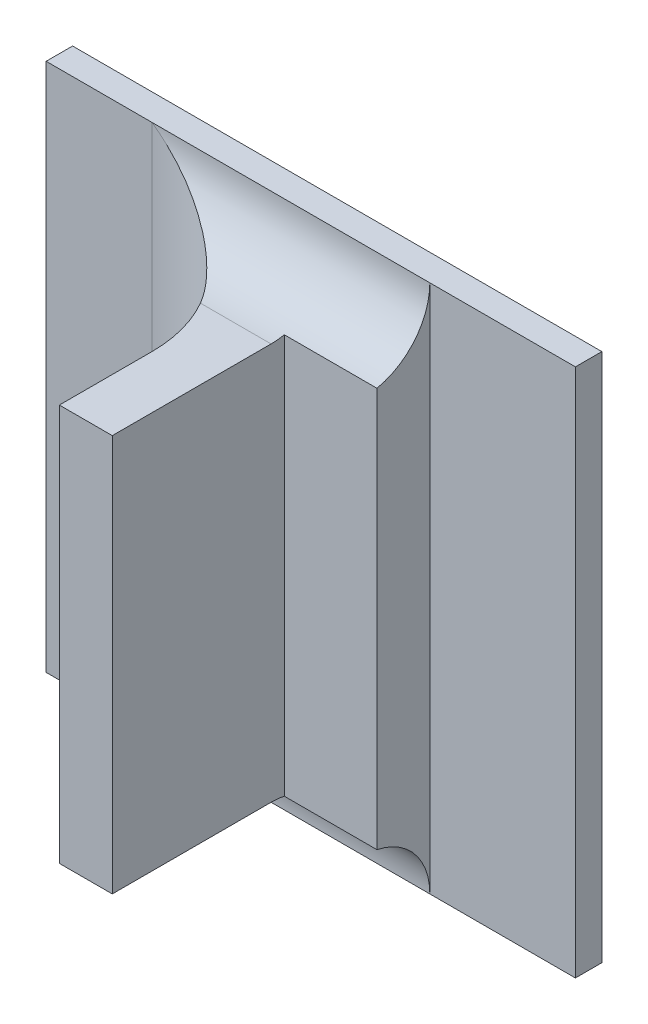
ISO-10303-21;
HEADER;
FILE_DESCRIPTION(('STEP AP214'),'2;1');
FILE_NAME('part.step','',(''),(''),'','','');
FILE_SCHEMA(('AUTOMOTIVE_DESIGN { 1 0 10303 214 1 1 1 1 }'));
ENDSEC;
DATA;
#1=APPLICATION_CONTEXT('core data for automotive mechanical design processes');
#2=APPLICATION_PROTOCOL_DEFINITION('international standard','automotive_design',2000,#1);
#3=PRODUCT_CONTEXT('',#1,'mechanical');
#4=PRODUCT('Part','Part','',(#3));
#5=PRODUCT_RELATED_PRODUCT_CATEGORY('part','',(#4));
#6=PRODUCT_DEFINITION_FORMATION('','',#4);
#7=PRODUCT_DEFINITION_CONTEXT('part definition',#1,'design');
#8=PRODUCT_DEFINITION('design','',#6,#7);
#9=PRODUCT_DEFINITION_SHAPE('','',#8);
#10=(LENGTH_UNIT() NAMED_UNIT(*) SI_UNIT(.MILLI.,.METRE.));
#11=(NAMED_UNIT(*) PLANE_ANGLE_UNIT() SI_UNIT($,.RADIAN.));
#12=(NAMED_UNIT(*) SI_UNIT($,.STERADIAN.) SOLID_ANGLE_UNIT());
#13=UNCERTAINTY_MEASURE_WITH_UNIT(LENGTH_MEASURE(1.E-05),#10,'distance_accuracy_value','');
#14=(GEOMETRIC_REPRESENTATION_CONTEXT(3) GLOBAL_UNCERTAINTY_ASSIGNED_CONTEXT((#13)) GLOBAL_UNIT_ASSIGNED_CONTEXT((#10,
#11,#12)) REPRESENTATION_CONTEXT('',''));
#15=CARTESIAN_POINT('',(0.,0.,0.));
#16=DIRECTION('',(0.,0.,1.));
#17=DIRECTION('',(1.,0.,0.));
#18=AXIS2_PLACEMENT_3D('',#15,#16,#17);
#19=CARTESIAN_POINT('',(-0.390095781372376,-0.311549667580546,0.0888870078740156));
#20=DIRECTION('',(0.,0.,1.));
#21=DIRECTION('',(1.,0.,0.));
#22=AXIS2_PLACEMENT_3D('',#19,#20,#21);
#23=PLANE('',#22);
#24=DIRECTION('',(1.,0.,0.));
#25=VECTOR('',#24,1.);
#26=CARTESIAN_POINT('',(-0.397411350834125,-0.351234706950624,0.0888870078740156));
#27=LINE('',#26,#25);
#28=CARTESIAN_POINT('',(-0.390347749876313,-0.351234706950624,0.0888870078740156));
#29=VERTEX_POINT('',#28);
#30=CARTESIAN_POINT('',(-0.395387119955053,-0.351234706950624,0.0888870078740156));
#31=VERTEX_POINT('',#30);
#32=EDGE_CURVE('E193',#29,#31,#27,.F.);
#33=ORIENTED_EDGE('',*,*,#32,.F.);
#34=DIRECTION('',(0.,1.,0.));
#35=VECTOR('',#34,1.);
#36=CARTESIAN_POINT('',(-0.390347749876313,-0.35326446766354,0.0888870078740156));
#37=LINE('',#36,#35);
#38=CARTESIAN_POINT('',(-0.390347749876313,-0.313439431360073,0.0888870078740156));
#39=VERTEX_POINT('',#38);
#40=EDGE_CURVE('E187',#39,#29,#37,.F.);
#41=ORIENTED_EDGE('',*,*,#40,.F.);
#42=DIRECTION('',(1.,0.,0.));
#43=VECTOR('',#42,1.);
#44=CARTESIAN_POINT('',(-0.397411350834125,-0.313439431360073,0.0888870078740156));
#45=LINE('',#44,#43);
#46=CARTESIAN_POINT('',(-0.395387119955053,-0.313439431360073,0.0888870078740156));
#47=VERTEX_POINT('',#46);
#48=EDGE_CURVE('E180',#39,#47,#45,.F.);
#49=ORIENTED_EDGE('',*,*,#48,.T.);
#50=DIRECTION('',(0.,-1.,0.));
#51=VECTOR('',#50,1.);
#52=CARTESIAN_POINT('',(-0.395387119955053,-0.311549667580546,0.0888870078740156));
#53=LINE('',#52,#51);
#54=EDGE_CURVE('E177',#31,#47,#53,.F.);
#55=ORIENTED_EDGE('',*,*,#54,.F.);
#56=EDGE_LOOP('',(#33,#41,#49,#55));
#57=FACE_BOUND('',#56,.T.);
#58=ADVANCED_FACE('F17',(#57),#23,.T.);
#59=CARTESIAN_POINT('',(-0.395387119955053,-0.311549667580546,0.0796271653543306));
#60=DIRECTION('',(-1.,0.,0.));
#61=DIRECTION('',(0.,-1.,0.));
#62=AXIS2_PLACEMENT_3D('',#59,#60,#61);
#63=PLANE('',#62);
#64=DIRECTION('',(0.,0.,1.));
#65=VECTOR('',#64,1.);
#66=CARTESIAN_POINT('',(-0.395387119955053,-0.313439431360073,0.0730129921259841));
#67=LINE('',#66,#65);
#68=CARTESIAN_POINT('',(-0.395387119955053,-0.313439431360073,0.0800681102362204));
#69=VERTEX_POINT('',#68);
#70=EDGE_CURVE('E184',#47,#69,#67,.F.);
#71=ORIENTED_EDGE('',*,*,#70,.T.);
#72=DIRECTION('',(0.,1.,0.));
#73=VECTOR('',#72,1.);
#74=CARTESIAN_POINT('',(-0.395387119955053,-0.36005360458842,0.0800681102362204));
#75=LINE('',#74,#73);
#76=CARTESIAN_POINT('',(-0.395387119955053,-0.351234706950624,0.0800681102362204));
#77=VERTEX_POINT('',#76);
#78=EDGE_CURVE('E127',#69,#77,#75,.F.);
#79=ORIENTED_EDGE('',*,*,#78,.T.);
#80=DIRECTION('',(0.,0.,1.));
#81=VECTOR('',#80,1.);
#82=CARTESIAN_POINT('',(-0.395387119955053,-0.351234706950624,0.0730129921259841));
#83=LINE('',#82,#81);
#84=EDGE_CURVE('E196',#31,#77,#83,.F.);
#85=ORIENTED_EDGE('',*,*,#84,.F.);
#86=ORIENTED_EDGE('',*,*,#54,.T.);
#87=EDGE_LOOP('',(#71,#79,#85,#86));
#88=FACE_BOUND('',#87,.T.);
#89=ADVANCED_FACE('F242',(#88),#63,.T.);
#90=CARTESIAN_POINT('',(-0.397411350834125,-0.313439431360073,0.0730129921259841));
#91=DIRECTION('',(0.,-1.,0.));
#92=DIRECTION('',(1.,0.,0.));
#93=AXIS2_PLACEMENT_3D('',#90,#91,#92);
#94=PLANE('',#93);
#95=ORIENTED_EDGE('',*,*,#70,.F.);
#96=ORIENTED_EDGE('',*,*,#48,.F.);
#97=DIRECTION('',(0.,0.,1.));
#98=VECTOR('',#97,1.);
#99=CARTESIAN_POINT('',(-0.390347749876313,-0.313439431360073,0.0716901574803148));
#100=LINE('',#99,#98);
#101=CARTESIAN_POINT('',(-0.390347749876313,-0.313439431360073,0.0737688976377952));
#102=VERTEX_POINT('',#101);
#103=EDGE_CURVE('E115',#102,#39,#100,.T.);
#104=ORIENTED_EDGE('',*,*,#103,.F.);
#105=DIRECTION('',(1.,0.,0.));
#106=VECTOR('',#105,1.);
#107=CARTESIAN_POINT('',(-0.409308379797573,-0.313439431360073,0.0737688976377952));
#108=LINE('',#107,#106);
#109=CARTESIAN_POINT('',(-0.397074988883753,-0.313439431360073,0.0737688976377952));
#110=VERTEX_POINT('',#109);
#111=EDGE_CURVE('E109',#102,#110,#108,.F.);
#112=ORIENTED_EDGE('',*,*,#111,.T.);
#113=CARTESIAN_POINT('',(-0.407985545151903,-0.313439431360073,0.0800681102362204));
#114=DIRECTION('',(0.,1.,0.));
#115=DIRECTION('',(-1.,0.,0.));
#116=AXIS2_PLACEMENT_3D('',#113,#114,#115);
#117=CIRCLE('',#116,0.0125984251968504);
#118=EDGE_CURVE('E20',#110,#69,#117,.F.);
#119=ORIENTED_EDGE('',*,*,#118,.T.);
#120=EDGE_LOOP('',(#95,#96,#104,#112,#119));
#121=FACE_BOUND('',#120,.T.);
#122=ADVANCED_FACE('F112',(#121),#94,.F.);
#123=CARTESIAN_POINT('',(-0.397411350834125,-0.351234706950624,0.0730129921259841));
#124=DIRECTION('',(0.,-1.,0.));
#125=DIRECTION('',(1.,0.,0.));
#126=AXIS2_PLACEMENT_3D('',#123,#124,#125);
#127=PLANE('',#126);
#128=CARTESIAN_POINT('',(-0.407985545151903,-0.351234706950624,0.0800681102362204));
#129=DIRECTION('',(0.,1.,0.));
#130=DIRECTION('',(-1.,0.,0.));
#131=AXIS2_PLACEMENT_3D('',#128,#129,#130);
#132=CIRCLE('',#131,0.0125984251968504);
#133=CARTESIAN_POINT('',(-0.397074988883753,-0.351234706950624,0.0737688976377951));
#134=VERTEX_POINT('',#133);
#135=EDGE_CURVE('E121',#77,#134,#132,.T.);
#136=ORIENTED_EDGE('',*,*,#135,.T.);
#137=DIRECTION('',(-1.,0.,0.));
#138=VECTOR('',#137,1.);
#139=CARTESIAN_POINT('',(-0.355072159325132,-0.351234706950625,0.0737688976377952));
#140=LINE('',#139,#138);
#141=CARTESIAN_POINT('',(-0.390347749876313,-0.351234706950624,0.0737688976377952));
#142=VERTEX_POINT('',#141);
#143=EDGE_CURVE('E169',#134,#142,#140,.F.);
#144=ORIENTED_EDGE('',*,*,#143,.T.);
#145=DIRECTION('',(0.,0.,1.));
#146=VECTOR('',#145,1.);
#147=CARTESIAN_POINT('',(-0.390347749876313,-0.351234706950624,0.0716901574803148));
#148=LINE('',#147,#146);
#149=EDGE_CURVE('E190',#29,#142,#148,.F.);
#150=ORIENTED_EDGE('',*,*,#149,.F.);
#151=ORIENTED_EDGE('',*,*,#32,.T.);
#152=ORIENTED_EDGE('',*,*,#84,.T.);
#153=EDGE_LOOP('',(#136,#144,#150,#151,#152));
#154=FACE_BOUND('',#153,.T.);
#155=ADVANCED_FACE('F235',(#154),#127,.T.);
#156=CARTESIAN_POINT('',(-0.390347749876313,-0.35326446766354,0.0716901574803148));
#157=DIRECTION('',(1.,0.,0.));
#158=DIRECTION('',(0.,1.,0.));
#159=AXIS2_PLACEMENT_3D('',#156,#157,#158);
#160=PLANE('',#159);
#161=DIRECTION('',(0.,1.,0.));
#162=VECTOR('',#161,1.);
#163=CARTESIAN_POINT('',(-0.390347749876313,-0.311409670647157,0.0725090551181101));
#164=LINE('',#163,#162);
#165=CARTESIAN_POINT('',(-0.390347749876313,-0.313312161420629,0.0725090551181101));
#166=VERTEX_POINT('',#165);
#167=CARTESIAN_POINT('',(-0.390347749876313,-0.351361976890068,0.0725090551181101));
#168=VERTEX_POINT('',#167);
#169=EDGE_CURVE('E216',#166,#168,#164,.F.);
#170=ORIENTED_EDGE('',*,*,#169,.F.);
#171=CARTESIAN_POINT('',(-0.390347749876313,-0.313312161420629,0.0725090551181101));
#172=CARTESIAN_POINT('',(-0.390347749876313,-0.313439431360073,0.0731325479405746));
#173=CARTESIAN_POINT('',(-0.390347749876313,-0.313439431360073,0.0737688976377952));
#174=B_SPLINE_CURVE_WITH_KNOTS('',2,(#171,#172,#173),.UNSPECIFIED.,.F.,.F.,(3,3),(0.,1.),.UNSPECIFIED.);
#175=EDGE_CURVE('E217',#166,#102,#174,.T.);
#176=ORIENTED_EDGE('',*,*,#175,.T.);
#177=ORIENTED_EDGE('',*,*,#103,.T.);
#178=ORIENTED_EDGE('',*,*,#40,.T.);
#179=ORIENTED_EDGE('',*,*,#149,.T.);
#180=CARTESIAN_POINT('',(-0.390347749876313,-0.351234706950624,0.0737688976377952));
#181=CARTESIAN_POINT('',(-0.390347749876313,-0.351234706950624,0.0731325479405795));
#182=CARTESIAN_POINT('',(-0.390347749876313,-0.351361976890068,0.0725090551181101));
#183=B_SPLINE_CURVE_WITH_KNOTS('',2,(#180,#181,#182),.UNSPECIFIED.,.F.,.F.,(3,3),(0.,1.),.UNSPECIFIED.);
#184=EDGE_CURVE('E221',#142,#168,#183,.T.);
#185=ORIENTED_EDGE('',*,*,#184,.T.);
#186=EDGE_LOOP('',(#170,#176,#177,#178,#179,#185));
#187=FACE_BOUND('',#186,.T.);
#188=ADVANCED_FACE('F224',(#187),#160,.T.);
#189=CARTESIAN_POINT('',(-0.381087907356628,-0.311409670647157,0.0725090551181101));
#190=DIRECTION('',(0.,0.,1.));
#191=DIRECTION('',(1.,0.,0.));
#192=AXIS2_PLACEMENT_3D('',#189,#190,#191);
#193=PLANE('',#192);
#194=DIRECTION('',(0.,1.,0.));
#195=VECTOR('',#194,1.);
#196=CARTESIAN_POINT('',(-0.381528852238517,-0.304620533722278,0.0725090551181101));
#197=LINE('',#196,#195);
#198=CARTESIAN_POINT('',(-0.381528852238517,-0.313312161420629,0.0725090551181101));
#199=VERTEX_POINT('',#198);
#200=CARTESIAN_POINT('',(-0.381528852238517,-0.351361976890069,0.0725090551181102));
#201=VERTEX_POINT('',#200);
#202=EDGE_CURVE('E128',#199,#201,#197,.F.);
#203=ORIENTED_EDGE('',*,*,#202,.F.);
#204=DIRECTION('',(1.,0.,0.));
#205=VECTOR('',#204,1.);
#206=CARTESIAN_POINT('',(-0.409308379797573,-0.313312161420629,0.0725090551181101));
#207=LINE('',#206,#205);
#208=EDGE_CURVE('E139',#199,#166,#207,.F.);
#209=ORIENTED_EDGE('',*,*,#208,.T.);
#210=ORIENTED_EDGE('',*,*,#169,.T.);
#211=DIRECTION('',(-1.,0.,0.));
#212=VECTOR('',#211,1.);
#213=CARTESIAN_POINT('',(-0.355072159325132,-0.351361976890069,0.0725090551181103));
#214=LINE('',#213,#212);
#215=EDGE_CURVE('E174',#168,#201,#214,.F.);
#216=ORIENTED_EDGE('',*,*,#215,.T.);
#217=EDGE_LOOP('',(#203,#209,#210,#216));
#218=FACE_BOUND('',#217,.T.);
#219=ADVANCED_FACE('F234',(#218),#193,.T.);
#220=CARTESIAN_POINT('',(-0.381528852238517,-0.304620533722278,0.067217716535433));
#221=DIRECTION('',(1.,0.,0.));
#222=DIRECTION('',(0.,1.,0.));
#223=AXIS2_PLACEMENT_3D('',#220,#221,#222);
#224=PLANE('',#223);
#225=DIRECTION('',(0.,1.,0.));
#226=VECTOR('',#225,1.);
#227=CARTESIAN_POINT('',(-0.381528852238517,-0.304620533722278,0.06746968503937));
#228=LINE('',#227,#226);
#229=CARTESIAN_POINT('',(-0.381528852238517,-0.35753391954905,0.06746968503937));
#230=VERTEX_POINT('',#229);
#231=CARTESIAN_POINT('',(-0.381528852238517,-0.307140218761648,0.06746968503937));
#232=VERTEX_POINT('',#231);
#233=EDGE_CURVE('E170',#230,#232,#228,.T.);
#234=ORIENTED_EDGE('',*,*,#233,.T.);
#235=CARTESIAN_POINT('',(-0.381528852238517,-0.307140218761648,0.0737688976377952));
#236=DIRECTION('',(1.,0.,0.));
#237=DIRECTION('',(0.,1.,0.));
#238=AXIS2_PLACEMENT_3D('',#235,#236,#237);
#239=CIRCLE('',#238,0.0062992125984252);
#240=EDGE_CURVE('E136',#232,#199,#239,.F.);
#241=ORIENTED_EDGE('',*,*,#240,.T.);
#242=ORIENTED_EDGE('',*,*,#202,.T.);
#243=CARTESIAN_POINT('',(-0.381528852238517,-0.35753391954905,0.0737688976377952));
#244=DIRECTION('',(-1.,0.,0.));
#245=DIRECTION('',(0.,-1.,0.));
#246=AXIS2_PLACEMENT_3D('',#243,#244,#245);
#247=CIRCLE('',#246,0.0062992125984252);
#248=EDGE_CURVE('E171',#201,#230,#247,.T.);
#249=ORIENTED_EDGE('',*,*,#248,.T.);
#250=EDGE_LOOP('',(#234,#241,#242,#249));
#251=FACE_BOUND('',#250,.T.);
#252=ADVANCED_FACE('F318',(#251),#224,.T.);
#253=CARTESIAN_POINT('',(-0.407985545151903,-0.36005360458842,0.0800681102362204));
#254=DIRECTION('',(0.,1.,0.));
#255=DIRECTION('',(-1.,0.,0.));
#256=AXIS2_PLACEMENT_3D('',#253,#254,#255);
#257=CYLINDRICAL_SURFACE('',#256,0.0125984251968504);
#258=ORIENTED_EDGE('',*,*,#78,.F.);
#259=ORIENTED_EDGE('',*,*,#118,.F.);
#260=CARTESIAN_POINT('',(-0.397074988883753,-0.313439431360073,0.073768897637795));
#261=CARTESIAN_POINT('',(-0.397347473388232,-0.313438873707853,0.0732955457546591));
#262=CARTESIAN_POINT('',(-0.397649585513836,-0.313386346377414,0.0728445682080298));
#263=CARTESIAN_POINT('',(-0.398295053287836,-0.313201363699116,0.0720003898002664));
#264=CARTESIAN_POINT('',(-0.398637785763093,-0.313070015578846,0.0716064807283954));
#265=CARTESIAN_POINT('',(-0.399423022887867,-0.312719656172453,0.0708064921171963));
#266=CARTESIAN_POINT('',(-0.39987209401617,-0.312488708936628,0.0704123993317733));
#267=CARTESIAN_POINT('',(-0.400802020277769,-0.311970610304802,0.0697017381084181));
#268=CARTESIAN_POINT('',(-0.401283053548465,-0.311683122697778,0.0693856602556568));
#269=CARTESIAN_POINT('',(-0.402463790992968,-0.310946965938325,0.0687164538298325));
#270=CARTESIAN_POINT('',(-0.40317306810433,-0.310480210038906,0.0684002761150404));
#271=CARTESIAN_POINT('',(-0.404610095819187,-0.309508649017801,0.0679065689436589));
#272=CARTESIAN_POINT('',(-0.405337814578964,-0.309003906866,0.0677288153407497));
#273=CARTESIAN_POINT('',(-0.406513777148443,-0.308179722442743,0.0675478835698786));
#274=CARTESIAN_POINT('',(-0.406959631932713,-0.307865289365079,0.0675035718032502));
#275=CARTESIAN_POINT('',(-0.407599052977282,-0.307413510055304,0.0674741343290926));
#276=CARTESIAN_POINT('',(-0.407792303626943,-0.307276860634179,0.0674696949622004));
#277=CARTESIAN_POINT('',(-0.407985545151903,-0.307140218761648,0.06746968503937));
#278=B_SPLINE_CURVE_WITH_KNOTS('',3,(#260,#261,#262,#263,#264,#265,#266,#267,#268,#269,#270,
#271,#272,#273,#274,#275,#276,#277),.UNSPECIFIED.,.F.,.F.,(4,2,2,2,2,2,2,2,4),(0.,
0.00162828046163534,0.00323420635682064,0.00514617952943936,0.00706988591555803,
0.00977367423346229,0.012473075225337,0.0141132082090726,0.0148232188039429),.UNSPECIFIED.);
#279=CARTESIAN_POINT('',(-0.407985545151903,-0.307140218761648,0.06746968503937));
#280=VERTEX_POINT('',#279);
#281=EDGE_CURVE('E120',#110,#280,#278,.T.);
#282=ORIENTED_EDGE('',*,*,#281,.T.);
#283=DIRECTION('',(0.,1.,0.));
#284=VECTOR('',#283,1.);
#285=CARTESIAN_POINT('',(-0.407985545151903,-0.304620533722278,0.06746968503937));
#286=LINE('',#285,#284);
#287=CARTESIAN_POINT('',(-0.407985545151903,-0.35753391954905,0.06746968503937));
#288=VERTEX_POINT('',#287);
#289=EDGE_CURVE('E173',#280,#288,#286,.F.);
#290=ORIENTED_EDGE('',*,*,#289,.T.);
#291=CARTESIAN_POINT('',(-0.397074988883753,-0.351234706950625,0.073768897637795));
#292=CARTESIAN_POINT('',(-0.397347473388232,-0.351235264602845,0.0732955457546591));
#293=CARTESIAN_POINT('',(-0.397649585513836,-0.351287791933284,0.0728445682080297));
#294=CARTESIAN_POINT('',(-0.398295053287836,-0.351472774611582,0.0720003898002664));
#295=CARTESIAN_POINT('',(-0.398637785763093,-0.351604122731852,0.0716064807283955));
#296=CARTESIAN_POINT('',(-0.399423022887867,-0.351954482138245,0.0708064921171964));
#297=CARTESIAN_POINT('',(-0.39987209401617,-0.35218542937407,0.0704123993317733));
#298=CARTESIAN_POINT('',(-0.400802020277769,-0.352703528005896,0.0697017381084181));
#299=CARTESIAN_POINT('',(-0.401283053548465,-0.35299101561292,0.0693856602556568));
#300=CARTESIAN_POINT('',(-0.402463790992968,-0.353727172372373,0.0687164538298325));
#301=CARTESIAN_POINT('',(-0.40317306810433,-0.354193928271792,0.0684002761150404));
#302=CARTESIAN_POINT('',(-0.404610095819187,-0.355165489292897,0.0679065689436589));
#303=CARTESIAN_POINT('',(-0.405337814578964,-0.355670231444698,0.0677288153407497));
#304=CARTESIAN_POINT('',(-0.406513777148443,-0.356494415867954,0.0675478835698786));
#305=CARTESIAN_POINT('',(-0.406959631932713,-0.356808848945619,0.0675035718032503));
#306=CARTESIAN_POINT('',(-0.407599052977282,-0.357260628255394,0.0674741343290926));
#307=CARTESIAN_POINT('',(-0.407792303626943,-0.357397277676519,0.0674696949622004));
#308=CARTESIAN_POINT('',(-0.407985545151903,-0.35753391954905,0.06746968503937));
#309=B_SPLINE_CURVE_WITH_KNOTS('',3,(#291,#292,#293,#294,#295,#296,#297,#298,#299,#300,#301,
#302,#303,#304,#305,#306,#307,#308),.UNSPECIFIED.,.F.,.F.,(4,2,2,2,2,2,2,2,4),(0.,
0.00162828046163536,0.00323420635682067,0.00514617952943937,0.00706988591555803,
0.00977367423346232,0.012473075225337,0.0141132082090727,0.014823218803943),.UNSPECIFIED.);
#310=EDGE_CURVE('E163',#288,#134,#309,.F.);
#311=ORIENTED_EDGE('',*,*,#310,.T.);
#312=ORIENTED_EDGE('',*,*,#135,.F.);
#313=EDGE_LOOP('',(#258,#259,#282,#290,#311,#312));
#314=FACE_BOUND('',#313,.T.);
#315=ADVANCED_FACE('F124',(#314),#257,.F.);
#316=CARTESIAN_POINT('',(-0.409308379797573,-0.307140218761648,0.0737688976377952));
#317=DIRECTION('',(1.,0.,0.));
#318=DIRECTION('',(0.,1.,0.));
#319=AXIS2_PLACEMENT_3D('',#316,#317,#318);
#320=CYLINDRICAL_SURFACE('',#319,0.0062992125984252);
#321=ORIENTED_EDGE('',*,*,#208,.F.);
#322=ORIENTED_EDGE('',*,*,#240,.F.);
#323=DIRECTION('',(-1.,0.,0.));
#324=VECTOR('',#323,1.);
#325=CARTESIAN_POINT('',(-0.365150899482612,-0.307140218761648,0.06746968503937));
#326=LINE('',#325,#324);
#327=EDGE_CURVE('E134',#280,#232,#326,.F.);
#328=ORIENTED_EDGE('',*,*,#327,.F.);
#329=ORIENTED_EDGE('',*,*,#281,.F.);
#330=ORIENTED_EDGE('',*,*,#111,.F.);
#331=ORIENTED_EDGE('',*,*,#175,.F.);
#332=EDGE_LOOP('',(#321,#322,#328,#329,#330,#331));
#333=FACE_BOUND('',#332,.T.);
#334=ADVANCED_FACE('F131',(#333),#320,.F.);
#335=CARTESIAN_POINT('',(-0.382221765624344,-0.304620533722278,0.06746968503937));
#336=DIRECTION('',(0.,0.,-1.));
#337=DIRECTION('',(-1.,0.,0.));
#338=AXIS2_PLACEMENT_3D('',#335,#336,#337);
#339=PLANE('',#338);
#340=DIRECTION('',(0.,1.,0.));
#341=VECTOR('',#340,1.);
#342=CARTESIAN_POINT('',(-0.367670584521982,-0.36005360458842,0.06746968503937));
#343=LINE('',#342,#341);
#344=CARTESIAN_POINT('',(-0.367670584521982,-0.307140218761648,0.06746968503937));
#345=VERTEX_POINT('',#344);
#346=CARTESIAN_POINT('',(-0.367670584521982,-0.35753391954905,0.06746968503937));
#347=VERTEX_POINT('',#346);
#348=EDGE_CURVE('E281',#345,#347,#343,.F.);
#349=ORIENTED_EDGE('',*,*,#348,.F.);
#350=DIRECTION('',(-1.,0.,0.));
#351=VECTOR('',#350,1.);
#352=CARTESIAN_POINT('',(-0.365150899482612,-0.307140218761648,0.06746968503937));
#353=LINE('',#352,#351);
#354=EDGE_CURVE('E206',#232,#345,#353,.F.);
#355=ORIENTED_EDGE('',*,*,#354,.F.);
#356=ORIENTED_EDGE('',*,*,#233,.F.);
#357=DIRECTION('',(1.,0.,0.));
#358=VECTOR('',#357,1.);
#359=CARTESIAN_POINT('',(-0.420583970348754,-0.35753391954905,0.06746968503937));
#360=LINE('',#359,#358);
#361=EDGE_CURVE('E283',#347,#230,#360,.F.);
#362=ORIENTED_EDGE('',*,*,#361,.F.);
#363=EDGE_LOOP('',(#349,#355,#356,#362));
#364=FACE_BOUND('',#363,.T.);
#365=ADVANCED_FACE('F152',(#364),#339,.F.);
#366=CARTESIAN_POINT('',(-0.355072159325132,-0.35753391954905,0.0737688976377952));
#367=DIRECTION('',(-1.,0.,0.));
#368=DIRECTION('',(0.,-1.,0.));
#369=AXIS2_PLACEMENT_3D('',#366,#367,#368);
#370=CYLINDRICAL_SURFACE('',#369,0.0062992125984252);
#371=ORIENTED_EDGE('',*,*,#215,.F.);
#372=ORIENTED_EDGE('',*,*,#184,.F.);
#373=ORIENTED_EDGE('',*,*,#143,.F.);
#374=ORIENTED_EDGE('',*,*,#310,.F.);
#375=DIRECTION('',(1.,0.,0.));
#376=VECTOR('',#375,1.);
#377=CARTESIAN_POINT('',(-0.420583970348754,-0.35753391954905,0.06746968503937));
#378=LINE('',#377,#376);
#379=EDGE_CURVE('E303',#230,#288,#378,.F.);
#380=ORIENTED_EDGE('',*,*,#379,.F.);
#381=ORIENTED_EDGE('',*,*,#248,.F.);
#382=EDGE_LOOP('',(#371,#372,#373,#374,#380,#381));
#383=FACE_BOUND('',#382,.T.);
#384=ADVANCED_FACE('F155',(#383),#370,.F.);
#385=CARTESIAN_POINT('',(-0.418568222317258,-0.304620533722278,0.06746968503937));
#386=DIRECTION('',(0.,0.,-1.));
#387=DIRECTION('',(-1.,0.,0.));
#388=AXIS2_PLACEMENT_3D('',#385,#386,#387);
#389=PLANE('',#388);
#390=DIRECTION('',(-1.,0.,0.));
#391=VECTOR('',#390,1.);
#392=CARTESIAN_POINT('',(-0.365150899482612,-0.307140218761648,0.06746968503937));
#393=LINE('',#392,#391);
#394=CARTESIAN_POINT('',(-0.418064285309384,-0.307140218761648,0.06746968503937));
#395=VERTEX_POINT('',#394);
#396=EDGE_CURVE('E298',#395,#280,#393,.F.);
#397=ORIENTED_EDGE('',*,*,#396,.F.);
#398=DIRECTION('',(0.,-1.,0.));
#399=VECTOR('',#398,1.);
#400=CARTESIAN_POINT('',(-0.418064285309384,-0.304620533722278,0.06746968503937));
#401=LINE('',#400,#399);
#402=CARTESIAN_POINT('',(-0.418064285309384,-0.35753391954905,0.06746968503937));
#403=VERTEX_POINT('',#402);
#404=EDGE_CURVE('E325',#403,#395,#401,.F.);
#405=ORIENTED_EDGE('',*,*,#404,.F.);
#406=DIRECTION('',(1.,0.,0.));
#407=VECTOR('',#406,1.);
#408=CARTESIAN_POINT('',(-0.420583970348754,-0.35753391954905,0.06746968503937));
#409=LINE('',#408,#407);
#410=EDGE_CURVE('E301',#288,#403,#409,.F.);
#411=ORIENTED_EDGE('',*,*,#410,.F.);
#412=ORIENTED_EDGE('',*,*,#289,.F.);
#413=EDGE_LOOP('',(#397,#405,#411,#412));
#414=FACE_BOUND('',#413,.T.);
#415=ADVANCED_FACE('F160',(#414),#389,.F.);
#416=CARTESIAN_POINT('',(-0.365150899482612,-0.307140218761648,0.0648240157480314));
#417=DIRECTION('',(0.,1.,0.));
#418=DIRECTION('',(-1.,0.,0.));
#419=AXIS2_PLACEMENT_3D('',#416,#417,#418);
#420=PLANE('',#419);
#421=ORIENTED_EDGE('',*,*,#354,.T.);
#422=DIRECTION('',(0.,0.,1.));
#423=VECTOR('',#422,1.);
#424=CARTESIAN_POINT('',(-0.367670584521982,-0.307140218761648,0.0648240157480314));
#425=LINE('',#424,#423);
#426=CARTESIAN_POINT('',(-0.367670584521982,-0.307140218761648,0.0649499999999999));
#427=VERTEX_POINT('',#426);
#428=EDGE_CURVE('E208',#427,#345,#425,.T.);
#429=ORIENTED_EDGE('',*,*,#428,.F.);
#430=DIRECTION('',(-1.,0.,0.));
#431=VECTOR('',#430,1.);
#432=CARTESIAN_POINT('',(-0.420583970348754,-0.307140218761648,0.0649499999999999));
#433=LINE('',#432,#431);
#434=CARTESIAN_POINT('',(-0.418064285309384,-0.307140218761648,0.0649499999999999));
#435=VERTEX_POINT('',#434);
#436=EDGE_CURVE('E332',#435,#427,#433,.F.);
#437=ORIENTED_EDGE('',*,*,#436,.F.);
#438=DIRECTION('',(0.,0.,1.));
#439=VECTOR('',#438,1.);
#440=CARTESIAN_POINT('',(-0.418064285309384,-0.307140218761648,0.0648240157480314));
#441=LINE('',#440,#439);
#442=EDGE_CURVE('E329',#395,#435,#441,.F.);
#443=ORIENTED_EDGE('',*,*,#442,.F.);
#444=ORIENTED_EDGE('',*,*,#396,.T.);
#445=ORIENTED_EDGE('',*,*,#327,.T.);
#446=EDGE_LOOP('',(#421,#429,#437,#443,#444,#445));
#447=FACE_BOUND('',#446,.T.);
#448=ADVANCED_FACE('F267',(#447),#420,.T.);
#449=CARTESIAN_POINT('',(-0.367670584521982,-0.36005360458842,0.0648240157480314));
#450=DIRECTION('',(1.,0.,0.));
#451=DIRECTION('',(0.,1.,0.));
#452=AXIS2_PLACEMENT_3D('',#449,#450,#451);
#453=PLANE('',#452);
#454=ORIENTED_EDGE('',*,*,#348,.T.);
#455=DIRECTION('',(0.,0.,1.));
#456=VECTOR('',#455,1.);
#457=CARTESIAN_POINT('',(-0.367670584521982,-0.35753391954905,0.0648240157480314));
#458=LINE('',#457,#456);
#459=CARTESIAN_POINT('',(-0.367670584521982,-0.35753391954905,0.0649499999999999));
#460=VERTEX_POINT('',#459);
#461=EDGE_CURVE('E285',#460,#347,#458,.T.);
#462=ORIENTED_EDGE('',*,*,#461,.F.);
#463=DIRECTION('',(0.,1.,0.));
#464=VECTOR('',#463,1.);
#465=CARTESIAN_POINT('',(-0.367670584521982,-0.304620533722278,0.0649499999999999));
#466=LINE('',#465,#464);
#467=EDGE_CURVE('E288',#427,#460,#466,.F.);
#468=ORIENTED_EDGE('',*,*,#467,.F.);
#469=ORIENTED_EDGE('',*,*,#428,.T.);
#470=EDGE_LOOP('',(#454,#462,#468,#469));
#471=FACE_BOUND('',#470,.T.);
#472=ADVANCED_FACE('F265',(#471),#453,.T.);
#473=CARTESIAN_POINT('',(-0.420583970348754,-0.35753391954905,0.0648240157480314));
#474=DIRECTION('',(0.,-1.,0.));
#475=DIRECTION('',(1.,0.,0.));
#476=AXIS2_PLACEMENT_3D('',#473,#474,#475);
#477=PLANE('',#476);
#478=ORIENTED_EDGE('',*,*,#410,.T.);
#479=DIRECTION('',(0.,0.,1.));
#480=VECTOR('',#479,1.);
#481=CARTESIAN_POINT('',(-0.418064285309384,-0.35753391954905,0.0648240157480314));
#482=LINE('',#481,#480);
#483=CARTESIAN_POINT('',(-0.418064285309384,-0.35753391954905,0.0649499999999999));
#484=VERTEX_POINT('',#483);
#485=EDGE_CURVE('E35',#484,#403,#482,.T.);
#486=ORIENTED_EDGE('',*,*,#485,.F.);
#487=DIRECTION('',(-1.,0.,0.));
#488=VECTOR('',#487,1.);
#489=CARTESIAN_POINT('',(-0.420583970348754,-0.35753391954905,0.0649499999999999));
#490=LINE('',#489,#488);
#491=EDGE_CURVE('E26',#460,#484,#490,.T.);
#492=ORIENTED_EDGE('',*,*,#491,.F.);
#493=ORIENTED_EDGE('',*,*,#461,.T.);
#494=ORIENTED_EDGE('',*,*,#361,.T.);
#495=ORIENTED_EDGE('',*,*,#379,.T.);
#496=EDGE_LOOP('',(#478,#486,#492,#493,#494,#495));
#497=FACE_BOUND('',#496,.T.);
#498=ADVANCED_FACE('F258',(#497),#477,.T.);
#499=CARTESIAN_POINT('',(-0.418064285309384,-0.304620533722278,0.0648240157480314));
#500=DIRECTION('',(-1.,0.,0.));
#501=DIRECTION('',(0.,-1.,0.));
#502=AXIS2_PLACEMENT_3D('',#499,#500,#501);
#503=PLANE('',#502);
#504=ORIENTED_EDGE('',*,*,#404,.T.);
#505=ORIENTED_EDGE('',*,*,#442,.T.);
#506=DIRECTION('',(0.,1.,0.));
#507=VECTOR('',#506,1.);
#508=CARTESIAN_POINT('',(-0.418064285309384,-0.304620533722278,0.0649499999999999));
#509=LINE('',#508,#507);
#510=EDGE_CURVE('E11',#484,#435,#509,.T.);
#511=ORIENTED_EDGE('',*,*,#510,.F.);
#512=ORIENTED_EDGE('',*,*,#485,.T.);
#513=EDGE_LOOP('',(#504,#505,#511,#512));
#514=FACE_BOUND('',#513,.T.);
#515=ADVANCED_FACE('F252',(#514),#503,.T.);
#516=CARTESIAN_POINT('',(-0.420583970348754,-0.304620533722278,0.0649499999999999));
#517=DIRECTION('',(0.,0.,-1.));
#518=DIRECTION('',(-1.,0.,0.));
#519=AXIS2_PLACEMENT_3D('',#516,#517,#518);
#520=PLANE('',#519);
#521=ORIENTED_EDGE('',*,*,#491,.T.);
#522=ORIENTED_EDGE('',*,*,#510,.T.);
#523=ORIENTED_EDGE('',*,*,#436,.T.);
#524=ORIENTED_EDGE('',*,*,#467,.T.);
#525=EDGE_LOOP('',(#521,#522,#523,#524));
#526=FACE_BOUND('',#525,.T.);
#527=ADVANCED_FACE('F250',(#526),#520,.T.);
#528=CLOSED_SHELL('',(#58,#89,#122,#155,#188,#219,#252,#315,#334,#365,#384,#415,#448,#472,#498,
#515,#527));
#529=MANIFOLD_SOLID_BREP('B1',#528);
#530=ADVANCED_BREP_SHAPE_REPRESENTATION('',(#18,#529),#14);
#531=SHAPE_DEFINITION_REPRESENTATION(#9,#530);
ENDSEC;
END-ISO-10303-21;
